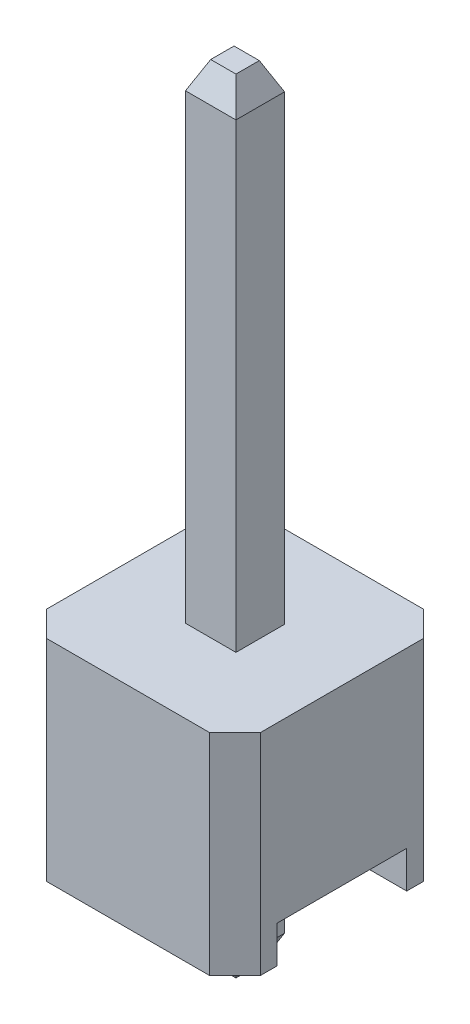
ISO-10303-21;
HEADER;
FILE_DESCRIPTION(('STEP AP214'),'2;1');
FILE_NAME('part.step','',(''),(''),'','','');
FILE_SCHEMA(('AUTOMOTIVE_DESIGN { 1 0 10303 214 1 1 1 1 }'));
ENDSEC;
DATA;
#1=APPLICATION_CONTEXT('core data for automotive mechanical design processes');
#2=APPLICATION_PROTOCOL_DEFINITION('international standard','automotive_design',2000,#1);
#3=PRODUCT_CONTEXT('',#1,'mechanical');
#4=PRODUCT('Part','Part','',(#3));
#5=PRODUCT_RELATED_PRODUCT_CATEGORY('part','',(#4));
#6=PRODUCT_DEFINITION_FORMATION('','',#4);
#7=PRODUCT_DEFINITION_CONTEXT('part definition',#1,'design');
#8=PRODUCT_DEFINITION('design','',#6,#7);
#9=PRODUCT_DEFINITION_SHAPE('','',#8);
#10=(LENGTH_UNIT() NAMED_UNIT(*) SI_UNIT(.MILLI.,.METRE.));
#11=(NAMED_UNIT(*) PLANE_ANGLE_UNIT() SI_UNIT($,.RADIAN.));
#12=(NAMED_UNIT(*) SI_UNIT($,.STERADIAN.) SOLID_ANGLE_UNIT());
#13=UNCERTAINTY_MEASURE_WITH_UNIT(LENGTH_MEASURE(1.E-05),#10,'distance_accuracy_value','');
#14=(GEOMETRIC_REPRESENTATION_CONTEXT(3) GLOBAL_UNCERTAINTY_ASSIGNED_CONTEXT((#13)) GLOBAL_UNIT_ASSIGNED_CONTEXT((#10,
#11,#12)) REPRESENTATION_CONTEXT('',''));
#15=CARTESIAN_POINT('',(0.,0.,0.));
#16=DIRECTION('',(0.,0.,1.));
#17=DIRECTION('',(1.,0.,0.));
#18=AXIS2_PLACEMENT_3D('',#15,#16,#17);
#19=CARTESIAN_POINT('',(15.6674969604626,-5.69124998633488,4.81287404611807));
#20=DIRECTION('',(0.,-1.,0.));
#21=DIRECTION('',(0.,0.,-1.));
#22=AXIS2_PLACEMENT_3D('',#19,#20,#21);
#23=PLANE('',#22);
#24=DIRECTION('',(1.,0.,0.));
#25=VECTOR('',#24,1.);
#26=CARTESIAN_POINT('',(15.0674969604626,-5.69124998633488,4.96287404611807));
#27=LINE('',#26,#25);
#28=CARTESIAN_POINT('',(15.2174969604626,-5.69124998633488,4.96287404611807));
#29=VERTEX_POINT('',#28);
#30=CARTESIAN_POINT('',(15.5174969604626,-5.69124998633488,4.96287404611807));
#31=VERTEX_POINT('',#30);
#32=EDGE_CURVE('E193',#29,#31,#27,.T.);
#33=ORIENTED_EDGE('',*,*,#32,.T.);
#34=DIRECTION('',(0.,0.,1.));
#35=VECTOR('',#34,1.);
#36=CARTESIAN_POINT('',(15.5174969604626,-5.69124998633488,4.81287404611807));
#37=LINE('',#36,#35);
#38=CARTESIAN_POINT('',(15.5174969604626,-5.69124998633488,5.24038017622598));
#39=VERTEX_POINT('',#38);
#40=EDGE_CURVE('E178',#31,#39,#37,.T.);
#41=ORIENTED_EDGE('',*,*,#40,.T.);
#42=DIRECTION('',(1.,0.,0.));
#43=VECTOR('',#42,1.);
#44=CARTESIAN_POINT('',(15.6674969604626,-5.69124998633488,5.24038017622598));
#45=LINE('',#44,#43);
#46=CARTESIAN_POINT('',(15.2174969604626,-5.69124998633488,5.24038017622598));
#47=VERTEX_POINT('',#46);
#48=EDGE_CURVE('E19',#39,#47,#45,.F.);
#49=ORIENTED_EDGE('',*,*,#48,.T.);
#50=DIRECTION('',(0.,0.,1.));
#51=VECTOR('',#50,1.);
#52=CARTESIAN_POINT('',(15.2174969604626,-5.69124998633488,5.39038017622598));
#53=LINE('',#52,#51);
#54=EDGE_CURVE('E173',#47,#29,#53,.F.);
#55=ORIENTED_EDGE('',*,*,#54,.T.);
#56=EDGE_LOOP('',(#33,#41,#49,#55));
#57=FACE_BOUND('',#56,.T.);
#58=ADVANCED_FACE('F16',(#57),#23,.T.);
#59=CARTESIAN_POINT('',(15.6674969604626,-5.36957394825845,5.39038017622598));
#60=DIRECTION('',(0.,0.4226182617407,-0.90630778703665));
#61=DIRECTION('',(0.,0.90630778703665,0.4226182617407));
#62=AXIS2_PLACEMENT_3D('',#59,#60,#61);
#63=PLANE('',#62);
#64=DIRECTION('',(1.,0.,0.));
#65=VECTOR('',#64,1.);
#66=CARTESIAN_POINT('',(15.6674969604626,-5.36957394825845,5.39038017622598));
#67=LINE('',#66,#65);
#68=CARTESIAN_POINT('',(15.0674969604626,-5.36957394825845,5.39038017622598));
#69=VERTEX_POINT('',#68);
#70=CARTESIAN_POINT('',(15.6674969604626,-5.36957394825845,5.39038017622598));
#71=VERTEX_POINT('',#70);
#72=EDGE_CURVE('E185',#69,#71,#67,.T.);
#73=ORIENTED_EDGE('',*,*,#72,.F.);
#74=DIRECTION('',(0.389281620635027,-0.834817129478987,-0.389281620635025));
#75=VECTOR('',#74,1.);
#76=CARTESIAN_POINT('',(15.0674969604626,-5.36957394825845,5.39038017622598));
#77=LINE('',#76,#75);
#78=EDGE_CURVE('E181',#69,#47,#77,.T.);
#79=ORIENTED_EDGE('',*,*,#78,.T.);
#80=ORIENTED_EDGE('',*,*,#48,.F.);
#81=DIRECTION('',(0.389281620635028,0.834817129478986,0.389281620635026));
#82=VECTOR('',#81,1.);
#83=CARTESIAN_POINT('',(15.5174969604626,-5.69124998633488,5.24038017622598));
#84=LINE('',#83,#82);
#85=EDGE_CURVE('E201',#39,#71,#84,.T.);
#86=ORIENTED_EDGE('',*,*,#85,.T.);
#87=EDGE_LOOP('',(#73,#79,#80,#86));
#88=FACE_BOUND('',#87,.T.);
#89=ADVANCED_FACE('F183',(#88),#63,.F.);
#90=CARTESIAN_POINT('',(15.0674969604626,-5.36957394825845,5.39038017622598));
#91=DIRECTION('',(0.906307787036649,0.422618261740701,0.));
#92=DIRECTION('',(-0.422618261740701,0.906307787036649,0.));
#93=AXIS2_PLACEMENT_3D('',#90,#91,#92);
#94=PLANE('',#93);
#95=ORIENTED_EDGE('',*,*,#54,.F.);
#96=ORIENTED_EDGE('',*,*,#78,.F.);
#97=DIRECTION('',(0.,0.,1.));
#98=VECTOR('',#97,1.);
#99=CARTESIAN_POINT('',(15.0674969604626,-5.36957394825845,5.39038017622598));
#100=LINE('',#99,#98);
#101=CARTESIAN_POINT('',(15.0674969604626,-5.36957394825845,4.81287404611807));
#102=VERTEX_POINT('',#101);
#103=EDGE_CURVE('E204',#102,#69,#100,.T.);
#104=ORIENTED_EDGE('',*,*,#103,.F.);
#105=DIRECTION('',(0.389281620635028,-0.834817129478986,0.389281620635026));
#106=VECTOR('',#105,1.);
#107=CARTESIAN_POINT('',(15.0674969604626,-5.36957394825845,4.81287404611807));
#108=LINE('',#107,#106);
#109=EDGE_CURVE('E190',#102,#29,#108,.T.);
#110=ORIENTED_EDGE('',*,*,#109,.T.);
#111=EDGE_LOOP('',(#95,#96,#104,#110));
#112=FACE_BOUND('',#111,.T.);
#113=ADVANCED_FACE('F188',(#112),#94,.F.);
#114=CARTESIAN_POINT('',(15.0674969604626,-5.36957394825845,4.81287404611807));
#115=DIRECTION('',(0.,0.422618261740701,0.906307787036649));
#116=DIRECTION('',(0.,-0.906307787036649,0.422618261740701));
#117=AXIS2_PLACEMENT_3D('',#114,#115,#116);
#118=PLANE('',#117);
#119=ORIENTED_EDGE('',*,*,#32,.F.);
#120=ORIENTED_EDGE('',*,*,#109,.F.);
#121=DIRECTION('',(-1.,0.,0.));
#122=VECTOR('',#121,1.);
#123=CARTESIAN_POINT('',(15.0674969604626,-5.36957394825845,4.81287404611807));
#124=LINE('',#123,#122);
#125=CARTESIAN_POINT('',(15.6674969604626,-5.36957394825845,4.81287404611807));
#126=VERTEX_POINT('',#125);
#127=EDGE_CURVE('E210',#126,#102,#124,.T.);
#128=ORIENTED_EDGE('',*,*,#127,.F.);
#129=DIRECTION('',(-0.389281620635029,-0.834817129478987,0.389281620635022));
#130=VECTOR('',#129,1.);
#131=CARTESIAN_POINT('',(15.6674969604626,-5.36957394825845,4.81287404611807));
#132=LINE('',#131,#130);
#133=EDGE_CURVE('E197',#126,#31,#132,.T.);
#134=ORIENTED_EDGE('',*,*,#133,.T.);
#135=EDGE_LOOP('',(#119,#120,#128,#134));
#136=FACE_BOUND('',#135,.T.);
#137=ADVANCED_FACE('F517',(#136),#118,.F.);
#138=CARTESIAN_POINT('',(15.6674969604626,-5.36957394825845,4.81287404611807));
#139=DIRECTION('',(-0.906307787036649,0.422618261740701,0.));
#140=DIRECTION('',(-0.422618261740701,-0.906307787036649,0.));
#141=AXIS2_PLACEMENT_3D('',#138,#139,#140);
#142=PLANE('',#141);
#143=ORIENTED_EDGE('',*,*,#40,.F.);
#144=ORIENTED_EDGE('',*,*,#133,.F.);
#145=DIRECTION('',(0.,0.,-1.));
#146=VECTOR('',#145,1.);
#147=CARTESIAN_POINT('',(15.6674969604626,-5.36957394825845,4.81287404611807));
#148=LINE('',#147,#146);
#149=EDGE_CURVE('E219',#71,#126,#148,.T.);
#150=ORIENTED_EDGE('',*,*,#149,.F.);
#151=ORIENTED_EDGE('',*,*,#85,.F.);
#152=EDGE_LOOP('',(#143,#144,#150,#151));
#153=FACE_BOUND('',#152,.T.);
#154=ADVANCED_FACE('F513',(#153),#142,.F.);
#155=CARTESIAN_POINT('',(15.6674969604626,-5.69124998633488,5.39038017622598));
#156=DIRECTION('',(0.,0.,1.));
#157=DIRECTION('',(1.,0.,0.));
#158=AXIS2_PLACEMENT_3D('',#155,#156,#157);
#159=PLANE('',#158);
#160=DIRECTION('',(0.,1.,0.));
#161=VECTOR('',#160,1.);
#162=CARTESIAN_POINT('',(15.6674969604626,-5.69124998633488,5.39038017622598));
#163=LINE('',#162,#161);
#164=CARTESIAN_POINT('',(15.6674969604626,-4.25124998633488,5.39038017622598));
#165=VERTEX_POINT('',#164);
#166=EDGE_CURVE('E216',#165,#71,#163,.F.);
#167=ORIENTED_EDGE('',*,*,#166,.F.);
#168=DIRECTION('',(1.,0.,0.));
#169=VECTOR('',#168,1.);
#170=CARTESIAN_POINT('',(14.0974969604626,-4.25124998633488,5.39038017622598));
#171=LINE('',#170,#169);
#172=CARTESIAN_POINT('',(15.0674969604626,-4.25124998633488,5.39038017622598));
#173=VERTEX_POINT('',#172);
#174=EDGE_CURVE('E229',#165,#173,#171,.F.);
#175=ORIENTED_EDGE('',*,*,#174,.T.);
#176=DIRECTION('',(0.,1.,0.));
#177=VECTOR('',#176,1.);
#178=CARTESIAN_POINT('',(15.0674969604626,-5.69124998633488,5.39038017622598));
#179=LINE('',#178,#177);
#180=EDGE_CURVE('E207',#69,#173,#179,.T.);
#181=ORIENTED_EDGE('',*,*,#180,.F.);
#182=ORIENTED_EDGE('',*,*,#72,.T.);
#183=EDGE_LOOP('',(#167,#175,#181,#182));
#184=FACE_BOUND('',#183,.T.);
#185=ADVANCED_FACE('F509',(#184),#159,.T.);
#186=CARTESIAN_POINT('',(15.0674969604626,-5.69124998633488,5.39038017622598));
#187=DIRECTION('',(-1.,0.,0.));
#188=DIRECTION('',(0.,0.,1.));
#189=AXIS2_PLACEMENT_3D('',#186,#187,#188);
#190=PLANE('',#189);
#191=ORIENTED_EDGE('',*,*,#180,.T.);
#192=DIRECTION('',(0.,0.,1.));
#193=VECTOR('',#192,1.);
#194=CARTESIAN_POINT('',(15.0674969604626,-4.25124998633488,5.87162711117202));
#195=LINE('',#194,#193);
#196=CARTESIAN_POINT('',(15.0674969604626,-4.25124998633488,4.81287404611807));
#197=VERTEX_POINT('',#196);
#198=EDGE_CURVE('E231',#173,#197,#195,.F.);
#199=ORIENTED_EDGE('',*,*,#198,.T.);
#200=DIRECTION('',(0.,1.,0.));
#201=VECTOR('',#200,1.);
#202=CARTESIAN_POINT('',(15.0674969604626,-5.69124998633488,4.81287404611807));
#203=LINE('',#202,#201);
#204=EDGE_CURVE('E213',#102,#197,#203,.T.);
#205=ORIENTED_EDGE('',*,*,#204,.F.);
#206=ORIENTED_EDGE('',*,*,#103,.T.);
#207=EDGE_LOOP('',(#191,#199,#205,#206));
#208=FACE_BOUND('',#207,.T.);
#209=ADVANCED_FACE('F505',(#208),#190,.T.);
#210=CARTESIAN_POINT('',(15.0674969604626,-5.69124998633488,4.81287404611807));
#211=DIRECTION('',(0.,0.,-1.));
#212=DIRECTION('',(-1.,0.,0.));
#213=AXIS2_PLACEMENT_3D('',#210,#211,#212);
#214=PLANE('',#213);
#215=ORIENTED_EDGE('',*,*,#204,.T.);
#216=DIRECTION('',(1.,0.,0.));
#217=VECTOR('',#216,1.);
#218=CARTESIAN_POINT('',(14.0974969604626,-4.25124998633488,4.81287404611807));
#219=LINE('',#218,#217);
#220=CARTESIAN_POINT('',(15.6674969604626,-4.25124998633488,4.81287404611807));
#221=VERTEX_POINT('',#220);
#222=EDGE_CURVE('E233',#197,#221,#219,.T.);
#223=ORIENTED_EDGE('',*,*,#222,.T.);
#224=DIRECTION('',(0.,1.,0.));
#225=VECTOR('',#224,1.);
#226=CARTESIAN_POINT('',(15.6674969604626,-5.69124998633488,4.81287404611807));
#227=LINE('',#226,#225);
#228=EDGE_CURVE('E222',#126,#221,#227,.T.);
#229=ORIENTED_EDGE('',*,*,#228,.F.);
#230=ORIENTED_EDGE('',*,*,#127,.T.);
#231=EDGE_LOOP('',(#215,#223,#229,#230));
#232=FACE_BOUND('',#231,.T.);
#233=ADVANCED_FACE('F501',(#232),#214,.T.);
#234=CARTESIAN_POINT('',(15.6674969604626,-5.69124998633488,4.81287404611807));
#235=DIRECTION('',(1.,0.,0.));
#236=DIRECTION('',(0.,0.,-1.));
#237=AXIS2_PLACEMENT_3D('',#234,#235,#236);
#238=PLANE('',#237);
#239=ORIENTED_EDGE('',*,*,#228,.T.);
#240=DIRECTION('',(0.,0.,1.));
#241=VECTOR('',#240,1.);
#242=CARTESIAN_POINT('',(15.6674969604626,-4.25124998633488,5.87162711117202));
#243=LINE('',#242,#241);
#244=EDGE_CURVE('E235',#221,#165,#243,.T.);
#245=ORIENTED_EDGE('',*,*,#244,.T.);
#246=ORIENTED_EDGE('',*,*,#166,.T.);
#247=ORIENTED_EDGE('',*,*,#149,.T.);
#248=EDGE_LOOP('',(#239,#245,#246,#247));
#249=FACE_BOUND('',#248,.T.);
#250=ADVANCED_FACE('F497',(#249),#238,.T.);
#251=CARTESIAN_POINT('',(14.0974969604626,-4.25124998633488,5.87162711117202));
#252=DIRECTION('',(0.,1.,0.));
#253=DIRECTION('',(0.,0.,1.));
#254=AXIS2_PLACEMENT_3D('',#251,#252,#253);
#255=PLANE('',#254);
#256=ORIENTED_EDGE('',*,*,#222,.F.);
#257=ORIENTED_EDGE('',*,*,#198,.F.);
#258=ORIENTED_EDGE('',*,*,#174,.F.);
#259=ORIENTED_EDGE('',*,*,#244,.F.);
#260=EDGE_LOOP('',(#256,#257,#258,#259));
#261=FACE_BOUND('',#260,.T.);
#262=DIRECTION('',(-1.,0.,0.));
#263=VECTOR('',#262,1.);
#264=CARTESIAN_POINT('',(14.0974969604626,-4.25124998633488,4.33162711117202));
#265=LINE('',#264,#263);
#266=CARTESIAN_POINT('',(14.0974969604626,-4.25124998633488,4.33162711117202));
#267=VERTEX_POINT('',#266);
#268=CARTESIAN_POINT('',(16.6374969604626,-4.25124998633488,4.33162711117202));
#269=VERTEX_POINT('',#268);
#270=EDGE_CURVE('E240',#267,#269,#265,.F.);
#271=ORIENTED_EDGE('',*,*,#270,.T.);
#272=DIRECTION('',(0.,0.,1.));
#273=VECTOR('',#272,1.);
#274=CARTESIAN_POINT('',(16.6374969604626,-4.25124998633488,5.87162711117202));
#275=LINE('',#274,#273);
#276=CARTESIAN_POINT('',(16.6374969604626,-4.25124998633488,5.87162711117202));
#277=VERTEX_POINT('',#276);
#278=EDGE_CURVE('E225',#277,#269,#275,.F.);
#279=ORIENTED_EDGE('',*,*,#278,.F.);
#280=DIRECTION('',(1.,0.,0.));
#281=VECTOR('',#280,1.);
#282=CARTESIAN_POINT('',(14.0974969604626,-4.25124998633488,5.87162711117202));
#283=LINE('',#282,#281);
#284=CARTESIAN_POINT('',(14.0974969604626,-4.25124998633488,5.87162711117202));
#285=VERTEX_POINT('',#284);
#286=EDGE_CURVE('E247',#277,#285,#283,.F.);
#287=ORIENTED_EDGE('',*,*,#286,.T.);
#288=DIRECTION('',(0.,0.,1.));
#289=VECTOR('',#288,1.);
#290=CARTESIAN_POINT('',(14.0974969604626,-4.25124998633488,5.87162711117202));
#291=LINE('',#290,#289);
#292=EDGE_CURVE('E227',#267,#285,#291,.T.);
#293=ORIENTED_EDGE('',*,*,#292,.F.);
#294=EDGE_LOOP('',(#271,#279,#287,#293));
#295=FACE_BOUND('',#294,.T.);
#296=ADVANCED_FACE('F494',(#261,#295),#255,.F.);
#297=CARTESIAN_POINT('',(15.5174969604626,3.60875001366512,4.81287404611807));
#298=DIRECTION('',(0.906307787036651,0.422618261740697,0.));
#299=DIRECTION('',(-0.422618261740697,0.906307787036651,0.));
#300=AXIS2_PLACEMENT_3D('',#297,#298,#299);
#301=PLANE('',#300);
#302=DIRECTION('',(0.389281620635022,-0.83481712947899,-0.389281620635024));
#303=VECTOR('',#302,1.);
#304=CARTESIAN_POINT('',(15.5174969604626,3.60875001366512,4.96287404611807));
#305=LINE('',#304,#303);
#306=CARTESIAN_POINT('',(15.5174969604626,3.60875001366512,4.96287404611807));
#307=VERTEX_POINT('',#306);
#308=CARTESIAN_POINT('',(15.6674969604626,3.28707397558869,4.81287404611807));
#309=VERTEX_POINT('',#308);
#310=EDGE_CURVE('E262',#307,#309,#305,.T.);
#311=ORIENTED_EDGE('',*,*,#310,.F.);
#312=DIRECTION('',(0.,0.,-1.));
#313=VECTOR('',#312,1.);
#314=CARTESIAN_POINT('',(15.5174969604626,3.60875001366512,4.81287404611807));
#315=LINE('',#314,#313);
#316=CARTESIAN_POINT('',(15.5174969604626,3.60875001366512,5.24038017622598));
#317=VERTEX_POINT('',#316);
#318=EDGE_CURVE('E255',#307,#317,#315,.F.);
#319=ORIENTED_EDGE('',*,*,#318,.T.);
#320=DIRECTION('',(-0.389281620635021,0.834817129478991,-0.389281620635023));
#321=VECTOR('',#320,1.);
#322=CARTESIAN_POINT('',(15.6674969604626,3.28707397558869,5.39038017622598));
#323=LINE('',#322,#321);
#324=CARTESIAN_POINT('',(15.6674969604626,3.28707397558869,5.39038017622598));
#325=VERTEX_POINT('',#324);
#326=EDGE_CURVE('E252',#325,#317,#323,.T.);
#327=ORIENTED_EDGE('',*,*,#326,.F.);
#328=DIRECTION('',(0.,0.,-1.));
#329=VECTOR('',#328,1.);
#330=CARTESIAN_POINT('',(15.6674969604626,3.28707397558869,4.81287404611807));
#331=LINE('',#330,#329);
#332=EDGE_CURVE('E265',#309,#325,#331,.F.);
#333=ORIENTED_EDGE('',*,*,#332,.F.);
#334=EDGE_LOOP('',(#311,#319,#327,#333));
#335=FACE_BOUND('',#334,.T.);
#336=ADVANCED_FACE('F471',(#335),#301,.T.);
#337=CARTESIAN_POINT('',(14.0974969604626,-4.25124998633488,4.33162711117202));
#338=DIRECTION('',(0.,0.,-1.));
#339=DIRECTION('',(-1.,0.,0.));
#340=AXIS2_PLACEMENT_3D('',#337,#338,#339);
#341=PLANE('',#340);
#342=DIRECTION('',(0.,1.,0.));
#343=VECTOR('',#342,1.);
#344=CARTESIAN_POINT('',(16.6374969604626,-4.25124998633488,4.33162711117202));
#345=LINE('',#344,#343);
#346=CARTESIAN_POINT('',(16.6374969604626,-4.69124998633488,4.33162711117202));
#347=VERTEX_POINT('',#346);
#348=EDGE_CURVE('E243',#269,#347,#345,.F.);
#349=ORIENTED_EDGE('',*,*,#348,.F.);
#350=ORIENTED_EDGE('',*,*,#270,.F.);
#351=DIRECTION('',(0.,1.,0.));
#352=VECTOR('',#351,1.);
#353=CARTESIAN_POINT('',(14.0974969604626,-4.25124998633488,4.33162711117202));
#354=LINE('',#353,#352);
#355=CARTESIAN_POINT('',(14.0974969604626,-4.69124998633488,4.33162711117202));
#356=VERTEX_POINT('',#355);
#357=EDGE_CURVE('E238',#356,#267,#354,.T.);
#358=ORIENTED_EDGE('',*,*,#357,.F.);
#359=DIRECTION('',(1.,0.,0.));
#360=VECTOR('',#359,1.);
#361=CARTESIAN_POINT('',(15.3674969604626,-4.69124998633488,4.33162711117202));
#362=LINE('',#361,#360);
#363=EDGE_CURVE('E272',#356,#347,#362,.T.);
#364=ORIENTED_EDGE('',*,*,#363,.T.);
#365=EDGE_LOOP('',(#349,#350,#358,#364));
#366=FACE_BOUND('',#365,.T.);
#367=ADVANCED_FACE('F487',(#366),#341,.F.);
#368=CARTESIAN_POINT('',(14.0974969604626,-4.25124998633488,5.87162711117202));
#369=DIRECTION('',(0.,0.,1.));
#370=DIRECTION('',(1.,0.,0.));
#371=AXIS2_PLACEMENT_3D('',#368,#369,#370);
#372=PLANE('',#371);
#373=DIRECTION('',(0.,1.,0.));
#374=VECTOR('',#373,1.);
#375=CARTESIAN_POINT('',(14.0974969604626,-4.25124998633488,5.87162711117202));
#376=LINE('',#375,#374);
#377=CARTESIAN_POINT('',(14.0974969604626,-4.69124998633488,5.87162711117202));
#378=VERTEX_POINT('',#377);
#379=EDGE_CURVE('E250',#285,#378,#376,.F.);
#380=ORIENTED_EDGE('',*,*,#379,.F.);
#381=ORIENTED_EDGE('',*,*,#286,.F.);
#382=DIRECTION('',(0.,1.,0.));
#383=VECTOR('',#382,1.);
#384=CARTESIAN_POINT('',(16.6374969604626,-4.25124998633488,5.87162711117202));
#385=LINE('',#384,#383);
#386=CARTESIAN_POINT('',(16.6374969604626,-4.69124998633488,5.87162711117202));
#387=VERTEX_POINT('',#386);
#388=EDGE_CURVE('E245',#387,#277,#385,.T.);
#389=ORIENTED_EDGE('',*,*,#388,.F.);
#390=DIRECTION('',(1.,0.,0.));
#391=VECTOR('',#390,1.);
#392=CARTESIAN_POINT('',(15.3674969604626,-4.69124998633488,5.87162711117202));
#393=LINE('',#392,#391);
#394=EDGE_CURVE('E287',#387,#378,#393,.F.);
#395=ORIENTED_EDGE('',*,*,#394,.T.);
#396=EDGE_LOOP('',(#380,#381,#389,#395));
#397=FACE_BOUND('',#396,.T.);
#398=ADVANCED_FACE('F481',(#397),#372,.F.);
#399=CARTESIAN_POINT('',(15.6674969604626,3.60875001366512,5.24038017622598));
#400=DIRECTION('',(0.,0.422618261740697,0.906307787036651));
#401=DIRECTION('',(0.,-0.906307787036651,0.422618261740697));
#402=AXIS2_PLACEMENT_3D('',#399,#400,#401);
#403=PLANE('',#402);
#404=ORIENTED_EDGE('',*,*,#326,.T.);
#405=DIRECTION('',(1.,0.,0.));
#406=VECTOR('',#405,1.);
#407=CARTESIAN_POINT('',(15.6674969604626,3.60875001366512,5.24038017622598));
#408=LINE('',#407,#406);
#409=CARTESIAN_POINT('',(15.2174969604626,3.60875001366512,5.24038017622598));
#410=VERTEX_POINT('',#409);
#411=EDGE_CURVE('E257',#317,#410,#408,.F.);
#412=ORIENTED_EDGE('',*,*,#411,.T.);
#413=DIRECTION('',(0.389281620635024,0.83481712947899,-0.389281620635022));
#414=VECTOR('',#413,1.);
#415=CARTESIAN_POINT('',(15.0674969604626,3.28707397558869,5.39038017622598));
#416=LINE('',#415,#414);
#417=CARTESIAN_POINT('',(15.0674969604626,3.28707397558869,5.39038017622598));
#418=VERTEX_POINT('',#417);
#419=EDGE_CURVE('E309',#418,#410,#416,.T.);
#420=ORIENTED_EDGE('',*,*,#419,.F.);
#421=DIRECTION('',(1.,0.,0.));
#422=VECTOR('',#421,1.);
#423=CARTESIAN_POINT('',(15.6674969604626,3.28707397558869,5.39038017622598));
#424=LINE('',#423,#422);
#425=EDGE_CURVE('E302',#325,#418,#424,.F.);
#426=ORIENTED_EDGE('',*,*,#425,.F.);
#427=EDGE_LOOP('',(#404,#412,#420,#426));
#428=FACE_BOUND('',#427,.T.);
#429=ADVANCED_FACE('F465',(#428),#403,.T.);
#430=CARTESIAN_POINT('',(15.6674969604626,3.60875001366512,4.81287404611807));
#431=DIRECTION('',(0.,-1.,0.));
#432=DIRECTION('',(0.,0.,-1.));
#433=AXIS2_PLACEMENT_3D('',#430,#431,#432);
#434=PLANE('',#433);
#435=ORIENTED_EDGE('',*,*,#318,.F.);
#436=DIRECTION('',(1.,0.,0.));
#437=VECTOR('',#436,1.);
#438=CARTESIAN_POINT('',(15.6674969604626,3.60875001366512,4.96287404611807));
#439=LINE('',#438,#437);
#440=CARTESIAN_POINT('',(15.2174969604626,3.60875001366512,4.96287404611807));
#441=VERTEX_POINT('',#440);
#442=EDGE_CURVE('E259',#441,#307,#439,.T.);
#443=ORIENTED_EDGE('',*,*,#442,.F.);
#444=DIRECTION('',(0.,0.,1.));
#445=VECTOR('',#444,1.);
#446=CARTESIAN_POINT('',(15.2174969604626,3.60875001366512,4.81287404611807));
#447=LINE('',#446,#445);
#448=EDGE_CURVE('E312',#410,#441,#447,.F.);
#449=ORIENTED_EDGE('',*,*,#448,.F.);
#450=ORIENTED_EDGE('',*,*,#411,.F.);
#451=EDGE_LOOP('',(#435,#443,#449,#450));
#452=FACE_BOUND('',#451,.T.);
#453=ADVANCED_FACE('F473',(#452),#434,.F.);
#454=CARTESIAN_POINT('',(15.6674969604626,3.60875001366512,4.96287404611807));
#455=DIRECTION('',(0.,0.422618261740697,-0.906307787036651));
#456=DIRECTION('',(0.,0.906307787036651,0.422618261740697));
#457=AXIS2_PLACEMENT_3D('',#454,#455,#456);
#458=PLANE('',#457);
#459=ORIENTED_EDGE('',*,*,#310,.T.);
#460=DIRECTION('',(-1.,0.,0.));
#461=VECTOR('',#460,1.);
#462=CARTESIAN_POINT('',(15.0674969604626,3.28707397558869,4.81287404611807));
#463=LINE('',#462,#461);
#464=CARTESIAN_POINT('',(15.0674969604626,3.28707397558869,4.81287404611807));
#465=VERTEX_POINT('',#464);
#466=EDGE_CURVE('E315',#465,#309,#463,.F.);
#467=ORIENTED_EDGE('',*,*,#466,.F.);
#468=DIRECTION('',(-0.389281620635025,-0.834817129478991,-0.389281620635018));
#469=VECTOR('',#468,1.);
#470=CARTESIAN_POINT('',(15.2174969604626,3.60875001366512,4.96287404611807));
#471=LINE('',#470,#469);
#472=EDGE_CURVE('E306',#441,#465,#471,.T.);
#473=ORIENTED_EDGE('',*,*,#472,.F.);
#474=ORIENTED_EDGE('',*,*,#442,.T.);
#475=EDGE_LOOP('',(#459,#467,#473,#474));
#476=FACE_BOUND('',#475,.T.);
#477=ADVANCED_FACE('F470',(#476),#458,.T.);
#478=CARTESIAN_POINT('',(15.6674969604626,-5.69124998633488,4.81287404611807));
#479=DIRECTION('',(1.,0.,0.));
#480=DIRECTION('',(0.,0.,-1.));
#481=AXIS2_PLACEMENT_3D('',#478,#479,#480);
#482=PLANE('',#481);
#483=DIRECTION('',(0.,1.,0.));
#484=VECTOR('',#483,1.);
#485=CARTESIAN_POINT('',(15.6674969604626,-5.69124998633488,5.39038017622598));
#486=LINE('',#485,#484);
#487=CARTESIAN_POINT('',(15.6674969604626,-2.19124998633488,5.39038017622598));
#488=VERTEX_POINT('',#487);
#489=EDGE_CURVE('E299',#488,#325,#486,.T.);
#490=ORIENTED_EDGE('',*,*,#489,.F.);
#491=DIRECTION('',(0.,0.,-1.));
#492=VECTOR('',#491,1.);
#493=CARTESIAN_POINT('',(15.6674969604626,-2.19124998633488,4.81287404611807));
#494=LINE('',#493,#492);
#495=CARTESIAN_POINT('',(15.6674969604626,-2.19124998633488,4.81287404611807));
#496=VERTEX_POINT('',#495);
#497=EDGE_CURVE('E268',#488,#496,#494,.T.);
#498=ORIENTED_EDGE('',*,*,#497,.T.);
#499=DIRECTION('',(0.,1.,0.));
#500=VECTOR('',#499,1.);
#501=CARTESIAN_POINT('',(15.6674969604626,-5.69124998633488,4.81287404611807));
#502=LINE('',#501,#500);
#503=EDGE_CURVE('E318',#309,#496,#502,.F.);
#504=ORIENTED_EDGE('',*,*,#503,.F.);
#505=ORIENTED_EDGE('',*,*,#332,.T.);
#506=EDGE_LOOP('',(#490,#498,#504,#505));
#507=FACE_BOUND('',#506,.T.);
#508=ADVANCED_FACE('F461',(#507),#482,.T.);
#509=CARTESIAN_POINT('',(15.3674969604626,-4.69124998633488,2.86162711117202));
#510=DIRECTION('',(0.,1.,0.));
#511=DIRECTION('',(0.,0.,1.));
#512=AXIS2_PLACEMENT_3D('',#509,#510,#511);
#513=PLANE('',#512);
#514=ORIENTED_EDGE('',*,*,#363,.F.);
#515=DIRECTION('',(0.,0.,1.));
#516=VECTOR('',#515,1.);
#517=CARTESIAN_POINT('',(14.0974969604626,-4.69124998633488,2.86162711117202));
#518=LINE('',#517,#516);
#519=CARTESIAN_POINT('',(14.0974969604626,-4.69124998633488,4.13162711117202));
#520=VERTEX_POINT('',#519);
#521=EDGE_CURVE('E270',#520,#356,#518,.T.);
#522=ORIENTED_EDGE('',*,*,#521,.F.);
#523=DIRECTION('',(0.707106781186547,0.,-0.707106781186548));
#524=VECTOR('',#523,1.);
#525=CARTESIAN_POINT('',(14.3974969604626,-4.69124998633488,3.83162711117202));
#526=LINE('',#525,#524);
#527=CARTESIAN_POINT('',(14.3974969604626,-4.69124998633488,3.83162711117202));
#528=VERTEX_POINT('',#527);
#529=EDGE_CURVE('E279',#520,#528,#526,.T.);
#530=ORIENTED_EDGE('',*,*,#529,.T.);
#531=DIRECTION('',(1.,0.,0.));
#532=VECTOR('',#531,1.);
#533=CARTESIAN_POINT('',(16.3374969604626,-4.69124998633488,3.83162711117202));
#534=LINE('',#533,#532);
#535=CARTESIAN_POINT('',(16.3374969604626,-4.69124998633488,3.83162711117202));
#536=VERTEX_POINT('',#535);
#537=EDGE_CURVE('E329',#528,#536,#534,.T.);
#538=ORIENTED_EDGE('',*,*,#537,.T.);
#539=DIRECTION('',(0.707106781186546,0.,0.707106781186549));
#540=VECTOR('',#539,1.);
#541=CARTESIAN_POINT('',(16.6374969604626,-4.69124998633488,4.13162711117202));
#542=LINE('',#541,#540);
#543=CARTESIAN_POINT('',(16.6374969604626,-4.69124998633488,4.13162711117202));
#544=VERTEX_POINT('',#543);
#545=EDGE_CURVE('E296',#536,#544,#542,.T.);
#546=ORIENTED_EDGE('',*,*,#545,.T.);
#547=DIRECTION('',(0.,0.,1.));
#548=VECTOR('',#547,1.);
#549=CARTESIAN_POINT('',(16.6374969604626,-4.69124998633488,2.86162711117202));
#550=LINE('',#549,#548);
#551=EDGE_CURVE('E275',#347,#544,#550,.F.);
#552=ORIENTED_EDGE('',*,*,#551,.F.);
#553=EDGE_LOOP('',(#514,#522,#530,#538,#546,#552));
#554=FACE_BOUND('',#553,.T.);
#555=ADVANCED_FACE('F633',(#554),#513,.F.);
#556=CARTESIAN_POINT('',(14.3974969604626,-2.19124998633488,3.83162711117202));
#557=DIRECTION('',(0.707106781186548,0.,0.707106781186547));
#558=DIRECTION('',(0.707106781186547,0.,-0.707106781186548));
#559=AXIS2_PLACEMENT_3D('',#556,#557,#558);
#560=PLANE('',#559);
#561=DIRECTION('',(0.,1.,0.));
#562=VECTOR('',#561,1.);
#563=CARTESIAN_POINT('',(14.0974969604626,-2.19124998633488,4.13162711117202));
#564=LINE('',#563,#562);
#565=CARTESIAN_POINT('',(14.0974969604626,-2.19124998633488,4.13162711117202));
#566=VERTEX_POINT('',#565);
#567=EDGE_CURVE('E332',#520,#566,#564,.T.);
#568=ORIENTED_EDGE('',*,*,#567,.T.);
#569=DIRECTION('',(0.707106781186547,0.,-0.707106781186548));
#570=VECTOR('',#569,1.);
#571=CARTESIAN_POINT('',(14.3974969604626,-2.19124998633488,3.83162711117202));
#572=LINE('',#571,#570);
#573=CARTESIAN_POINT('',(14.3974969604626,-2.19124998633488,3.83162711117202));
#574=VERTEX_POINT('',#573);
#575=EDGE_CURVE('E277',#574,#566,#572,.F.);
#576=ORIENTED_EDGE('',*,*,#575,.F.);
#577=DIRECTION('',(0.,1.,0.));
#578=VECTOR('',#577,1.);
#579=CARTESIAN_POINT('',(14.3974969604626,-2.19124998633488,3.83162711117202));
#580=LINE('',#579,#578);
#581=EDGE_CURVE('E326',#574,#528,#580,.F.);
#582=ORIENTED_EDGE('',*,*,#581,.T.);
#583=ORIENTED_EDGE('',*,*,#529,.F.);
#584=EDGE_LOOP('',(#568,#576,#582,#583));
#585=FACE_BOUND('',#584,.T.);
#586=ADVANCED_FACE('F394',(#585),#560,.F.);
#587=CARTESIAN_POINT('',(14.0974969604626,-2.19124998633488,6.07162711117202));
#588=DIRECTION('',(0.707106781186547,0.,-0.707106781186548));
#589=DIRECTION('',(-0.707106781186548,0.,-0.707106781186547));
#590=AXIS2_PLACEMENT_3D('',#587,#588,#589);
#591=PLANE('',#590);
#592=DIRECTION('',(0.,1.,0.));
#593=VECTOR('',#592,1.);
#594=CARTESIAN_POINT('',(14.3974969604626,-2.19124998633488,6.37162711117202));
#595=LINE('',#594,#593);
#596=CARTESIAN_POINT('',(14.3974969604626,-4.69124998633488,6.37162711117202));
#597=VERTEX_POINT('',#596);
#598=CARTESIAN_POINT('',(14.3974969604626,-2.19124998633488,6.37162711117202));
#599=VERTEX_POINT('',#598);
#600=EDGE_CURVE('E340',#597,#599,#595,.T.);
#601=ORIENTED_EDGE('',*,*,#600,.T.);
#602=DIRECTION('',(-0.707106781186548,0.,-0.707106781186547));
#603=VECTOR('',#602,1.);
#604=CARTESIAN_POINT('',(14.0974969604626,-2.19124998633488,6.07162711117202));
#605=LINE('',#604,#603);
#606=CARTESIAN_POINT('',(14.0974969604626,-2.19124998633488,6.07162711117202));
#607=VERTEX_POINT('',#606);
#608=EDGE_CURVE('E281',#607,#599,#605,.F.);
#609=ORIENTED_EDGE('',*,*,#608,.F.);
#610=DIRECTION('',(0.,1.,0.));
#611=VECTOR('',#610,1.);
#612=CARTESIAN_POINT('',(14.0974969604626,-2.19124998633488,6.07162711117202));
#613=LINE('',#612,#611);
#614=CARTESIAN_POINT('',(14.0974969604626,-4.69124998633488,6.07162711117202));
#615=VERTEX_POINT('',#614);
#616=EDGE_CURVE('E335',#607,#615,#613,.F.);
#617=ORIENTED_EDGE('',*,*,#616,.T.);
#618=DIRECTION('',(0.707106781186551,0.,0.707106781186544));
#619=VECTOR('',#618,1.);
#620=CARTESIAN_POINT('',(14.0974969604626,-4.69124998633488,6.07162711117202));
#621=LINE('',#620,#619);
#622=EDGE_CURVE('E283',#615,#597,#621,.T.);
#623=ORIENTED_EDGE('',*,*,#622,.T.);
#624=EDGE_LOOP('',(#601,#609,#617,#623));
#625=FACE_BOUND('',#624,.T.);
#626=ADVANCED_FACE('F401',(#625),#591,.F.);
#627=CARTESIAN_POINT('',(15.3674969604626,-4.69124998633488,2.86162711117202));
#628=DIRECTION('',(0.,1.,0.));
#629=DIRECTION('',(0.,0.,1.));
#630=AXIS2_PLACEMENT_3D('',#627,#628,#629);
#631=PLANE('',#630);
#632=ORIENTED_EDGE('',*,*,#394,.F.);
#633=DIRECTION('',(0.,0.,1.));
#634=VECTOR('',#633,1.);
#635=CARTESIAN_POINT('',(16.6374969604626,-4.69124998633488,2.86162711117202));
#636=LINE('',#635,#634);
#637=CARTESIAN_POINT('',(16.6374969604626,-4.69124998633488,6.07162711117202));
#638=VERTEX_POINT('',#637);
#639=EDGE_CURVE('E285',#638,#387,#636,.F.);
#640=ORIENTED_EDGE('',*,*,#639,.F.);
#641=DIRECTION('',(-0.707106781186549,0.,0.707106781186546));
#642=VECTOR('',#641,1.);
#643=CARTESIAN_POINT('',(16.3374969604626,-4.69124998633488,6.37162711117202));
#644=LINE('',#643,#642);
#645=CARTESIAN_POINT('',(16.3374969604626,-4.69124998633488,6.37162711117202));
#646=VERTEX_POINT('',#645);
#647=EDGE_CURVE('E292',#638,#646,#644,.T.);
#648=ORIENTED_EDGE('',*,*,#647,.T.);
#649=DIRECTION('',(-1.,0.,0.));
#650=VECTOR('',#649,1.);
#651=CARTESIAN_POINT('',(14.3974969604626,-4.69124998633488,6.37162711117202));
#652=LINE('',#651,#650);
#653=EDGE_CURVE('E346',#646,#597,#652,.T.);
#654=ORIENTED_EDGE('',*,*,#653,.T.);
#655=ORIENTED_EDGE('',*,*,#622,.F.);
#656=DIRECTION('',(0.,0.,-1.));
#657=VECTOR('',#656,1.);
#658=CARTESIAN_POINT('',(14.0974969604626,-4.69124998633488,4.13162711117202));
#659=LINE('',#658,#657);
#660=EDGE_CURVE('E337',#615,#378,#659,.T.);
#661=ORIENTED_EDGE('',*,*,#660,.T.);
#662=EDGE_LOOP('',(#632,#640,#648,#654,#655,#661));
#663=FACE_BOUND('',#662,.T.);
#664=ADVANCED_FACE('F404',(#663),#631,.F.);
#665=CARTESIAN_POINT('',(16.3374969604626,-2.19124998633488,6.37162711117202));
#666=DIRECTION('',(-0.707106781186546,0.,-0.707106781186549));
#667=DIRECTION('',(-0.707106781186549,0.,0.707106781186546));
#668=AXIS2_PLACEMENT_3D('',#665,#666,#667);
#669=PLANE('',#668);
#670=DIRECTION('',(0.,1.,0.));
#671=VECTOR('',#670,1.);
#672=CARTESIAN_POINT('',(16.6374969604626,-2.19124998633488,6.07162711117202));
#673=LINE('',#672,#671);
#674=CARTESIAN_POINT('',(16.6374969604626,-2.19124998633488,6.07162711117202));
#675=VERTEX_POINT('',#674);
#676=EDGE_CURVE('E349',#638,#675,#673,.T.);
#677=ORIENTED_EDGE('',*,*,#676,.T.);
#678=DIRECTION('',(-0.707106781186549,0.,0.707106781186546));
#679=VECTOR('',#678,1.);
#680=CARTESIAN_POINT('',(16.3374969604626,-2.19124998633488,6.37162711117202));
#681=LINE('',#680,#679);
#682=CARTESIAN_POINT('',(16.3374969604626,-2.19124998633488,6.37162711117202));
#683=VERTEX_POINT('',#682);
#684=EDGE_CURVE('E290',#683,#675,#681,.F.);
#685=ORIENTED_EDGE('',*,*,#684,.F.);
#686=DIRECTION('',(0.,1.,0.));
#687=VECTOR('',#686,1.);
#688=CARTESIAN_POINT('',(16.3374969604626,-2.19124998633488,6.37162711117202));
#689=LINE('',#688,#687);
#690=EDGE_CURVE('E343',#683,#646,#689,.F.);
#691=ORIENTED_EDGE('',*,*,#690,.T.);
#692=ORIENTED_EDGE('',*,*,#647,.F.);
#693=EDGE_LOOP('',(#677,#685,#691,#692));
#694=FACE_BOUND('',#693,.T.);
#695=ADVANCED_FACE('F413',(#694),#669,.F.);
#696=CARTESIAN_POINT('',(16.6374969604626,-2.19124998633488,4.13162711117202));
#697=DIRECTION('',(-0.707106781186549,0.,0.707106781186546));
#698=DIRECTION('',(0.707106781186546,0.,0.707106781186549));
#699=AXIS2_PLACEMENT_3D('',#696,#697,#698);
#700=PLANE('',#699);
#701=DIRECTION('',(0.,1.,0.));
#702=VECTOR('',#701,1.);
#703=CARTESIAN_POINT('',(16.3374969604626,-2.19124998633488,3.83162711117202));
#704=LINE('',#703,#702);
#705=CARTESIAN_POINT('',(16.3374969604626,-2.19124998633488,3.83162711117202));
#706=VERTEX_POINT('',#705);
#707=EDGE_CURVE('E323',#536,#706,#704,.T.);
#708=ORIENTED_EDGE('',*,*,#707,.T.);
#709=DIRECTION('',(0.707106781186546,0.,0.707106781186549));
#710=VECTOR('',#709,1.);
#711=CARTESIAN_POINT('',(16.6374969604626,-2.19124998633488,4.13162711117202));
#712=LINE('',#711,#710);
#713=CARTESIAN_POINT('',(16.6374969604626,-2.19124998633488,4.13162711117202));
#714=VERTEX_POINT('',#713);
#715=EDGE_CURVE('E294',#714,#706,#712,.F.);
#716=ORIENTED_EDGE('',*,*,#715,.F.);
#717=DIRECTION('',(0.,1.,0.));
#718=VECTOR('',#717,1.);
#719=CARTESIAN_POINT('',(16.6374969604626,-2.19124998633488,4.13162711117202));
#720=LINE('',#719,#718);
#721=EDGE_CURVE('E352',#714,#544,#720,.F.);
#722=ORIENTED_EDGE('',*,*,#721,.T.);
#723=ORIENTED_EDGE('',*,*,#545,.F.);
#724=EDGE_LOOP('',(#708,#716,#722,#723));
#725=FACE_BOUND('',#724,.T.);
#726=ADVANCED_FACE('F383',(#725),#700,.F.);
#727=CARTESIAN_POINT('',(15.6674969604626,-5.69124998633488,5.39038017622598));
#728=DIRECTION('',(0.,0.,1.));
#729=DIRECTION('',(1.,0.,0.));
#730=AXIS2_PLACEMENT_3D('',#727,#728,#729);
#731=PLANE('',#730);
#732=DIRECTION('',(0.,1.,0.));
#733=VECTOR('',#732,1.);
#734=CARTESIAN_POINT('',(15.0674969604626,-5.69124998633488,5.39038017622598));
#735=LINE('',#734,#733);
#736=CARTESIAN_POINT('',(15.0674969604626,-2.19124998633488,5.39038017622598));
#737=VERTEX_POINT('',#736);
#738=EDGE_CURVE('E355',#737,#418,#735,.T.);
#739=ORIENTED_EDGE('',*,*,#738,.F.);
#740=DIRECTION('',(1.,0.,0.));
#741=VECTOR('',#740,1.);
#742=CARTESIAN_POINT('',(15.6674969604626,-2.19124998633488,5.39038017622598));
#743=LINE('',#742,#741);
#744=EDGE_CURVE('E33',#737,#488,#743,.T.);
#745=ORIENTED_EDGE('',*,*,#744,.T.);
#746=ORIENTED_EDGE('',*,*,#489,.T.);
#747=ORIENTED_EDGE('',*,*,#425,.T.);
#748=EDGE_LOOP('',(#739,#745,#746,#747));
#749=FACE_BOUND('',#748,.T.);
#750=ADVANCED_FACE('F421',(#749),#731,.T.);
#751=CARTESIAN_POINT('',(15.2174969604626,3.60875001366512,4.81287404611807));
#752=DIRECTION('',(-0.906307787036651,0.422618261740697,0.));
#753=DIRECTION('',(-0.422618261740697,-0.906307787036651,0.));
#754=AXIS2_PLACEMENT_3D('',#751,#752,#753);
#755=PLANE('',#754);
#756=ORIENTED_EDGE('',*,*,#419,.T.);
#757=ORIENTED_EDGE('',*,*,#448,.T.);
#758=ORIENTED_EDGE('',*,*,#472,.T.);
#759=DIRECTION('',(0.,0.,1.));
#760=VECTOR('',#759,1.);
#761=CARTESIAN_POINT('',(15.0674969604626,3.28707397558869,5.39038017622598));
#762=LINE('',#761,#760);
#763=EDGE_CURVE('E358',#418,#465,#762,.F.);
#764=ORIENTED_EDGE('',*,*,#763,.F.);
#765=EDGE_LOOP('',(#756,#757,#758,#764));
#766=FACE_BOUND('',#765,.T.);
#767=ADVANCED_FACE('F444',(#766),#755,.T.);
#768=CARTESIAN_POINT('',(15.0674969604626,-5.69124998633488,4.81287404611807));
#769=DIRECTION('',(0.,0.,-1.));
#770=DIRECTION('',(-1.,0.,0.));
#771=AXIS2_PLACEMENT_3D('',#768,#769,#770);
#772=PLANE('',#771);
#773=ORIENTED_EDGE('',*,*,#503,.T.);
#774=DIRECTION('',(-1.,0.,0.));
#775=VECTOR('',#774,1.);
#776=CARTESIAN_POINT('',(15.0674969604626,-2.19124998633488,4.81287404611807));
#777=LINE('',#776,#775);
#778=CARTESIAN_POINT('',(15.0674969604626,-2.19124998633488,4.81287404611807));
#779=VERTEX_POINT('',#778);
#780=EDGE_CURVE('E321',#496,#779,#777,.T.);
#781=ORIENTED_EDGE('',*,*,#780,.T.);
#782=DIRECTION('',(0.,1.,0.));
#783=VECTOR('',#782,1.);
#784=CARTESIAN_POINT('',(15.0674969604626,-5.69124998633488,4.81287404611807));
#785=LINE('',#784,#783);
#786=EDGE_CURVE('E361',#465,#779,#785,.F.);
#787=ORIENTED_EDGE('',*,*,#786,.F.);
#788=ORIENTED_EDGE('',*,*,#466,.T.);
#789=EDGE_LOOP('',(#773,#781,#787,#788));
#790=FACE_BOUND('',#789,.T.);
#791=ADVANCED_FACE('F441',(#790),#772,.T.);
#792=CARTESIAN_POINT('',(16.3374969604626,-2.19124998633488,3.83162711117202));
#793=DIRECTION('',(0.,0.,1.));
#794=DIRECTION('',(1.,0.,0.));
#795=AXIS2_PLACEMENT_3D('',#792,#793,#794);
#796=PLANE('',#795);
#797=ORIENTED_EDGE('',*,*,#581,.F.);
#798=DIRECTION('',(1.,0.,0.));
#799=VECTOR('',#798,1.);
#800=CARTESIAN_POINT('',(15.3674969604626,-2.19124998633488,3.83162711117202));
#801=LINE('',#800,#799);
#802=EDGE_CURVE('E364',#706,#574,#801,.F.);
#803=ORIENTED_EDGE('',*,*,#802,.F.);
#804=ORIENTED_EDGE('',*,*,#707,.F.);
#805=ORIENTED_EDGE('',*,*,#537,.F.);
#806=EDGE_LOOP('',(#797,#803,#804,#805));
#807=FACE_BOUND('',#806,.T.);
#808=ADVANCED_FACE('F389',(#807),#796,.F.);
#809=CARTESIAN_POINT('',(14.0974969604626,-2.19124998633488,4.13162711117202));
#810=DIRECTION('',(1.,0.,0.));
#811=DIRECTION('',(0.,0.,-1.));
#812=AXIS2_PLACEMENT_3D('',#809,#810,#811);
#813=PLANE('',#812);
#814=ORIENTED_EDGE('',*,*,#379,.T.);
#815=ORIENTED_EDGE('',*,*,#660,.F.);
#816=ORIENTED_EDGE('',*,*,#616,.F.);
#817=DIRECTION('',(0.,0.,1.));
#818=VECTOR('',#817,1.);
#819=CARTESIAN_POINT('',(14.0974969604626,-2.19124998633488,2.86162711117202));
#820=LINE('',#819,#818);
#821=EDGE_CURVE('E367',#566,#607,#820,.T.);
#822=ORIENTED_EDGE('',*,*,#821,.F.);
#823=ORIENTED_EDGE('',*,*,#567,.F.);
#824=ORIENTED_EDGE('',*,*,#521,.T.);
#825=ORIENTED_EDGE('',*,*,#357,.T.);
#826=ORIENTED_EDGE('',*,*,#292,.T.);
#827=EDGE_LOOP('',(#814,#815,#816,#822,#823,#824,#825,#826));
#828=FACE_BOUND('',#827,.T.);
#829=ADVANCED_FACE('F397',(#828),#813,.F.);
#830=CARTESIAN_POINT('',(14.3974969604626,-2.19124998633488,6.37162711117202));
#831=DIRECTION('',(0.,0.,-1.));
#832=DIRECTION('',(-1.,0.,0.));
#833=AXIS2_PLACEMENT_3D('',#830,#831,#832);
#834=PLANE('',#833);
#835=ORIENTED_EDGE('',*,*,#690,.F.);
#836=DIRECTION('',(1.,0.,0.));
#837=VECTOR('',#836,1.);
#838=CARTESIAN_POINT('',(15.3674969604626,-2.19124998633488,6.37162711117202));
#839=LINE('',#838,#837);
#840=EDGE_CURVE('E370',#599,#683,#839,.T.);
#841=ORIENTED_EDGE('',*,*,#840,.F.);
#842=ORIENTED_EDGE('',*,*,#600,.F.);
#843=ORIENTED_EDGE('',*,*,#653,.F.);
#844=EDGE_LOOP('',(#835,#841,#842,#843));
#845=FACE_BOUND('',#844,.T.);
#846=ADVANCED_FACE('F411',(#845),#834,.F.);
#847=CARTESIAN_POINT('',(16.6374969604626,-2.19124998633488,6.07162711117202));
#848=DIRECTION('',(-1.,0.,0.));
#849=DIRECTION('',(0.,0.,1.));
#850=AXIS2_PLACEMENT_3D('',#847,#848,#849);
#851=PLANE('',#850);
#852=ORIENTED_EDGE('',*,*,#388,.T.);
#853=ORIENTED_EDGE('',*,*,#278,.T.);
#854=ORIENTED_EDGE('',*,*,#348,.T.);
#855=ORIENTED_EDGE('',*,*,#551,.T.);
#856=ORIENTED_EDGE('',*,*,#721,.F.);
#857=DIRECTION('',(0.,0.,1.));
#858=VECTOR('',#857,1.);
#859=CARTESIAN_POINT('',(16.6374969604626,-2.19124998633488,2.86162711117202));
#860=LINE('',#859,#858);
#861=EDGE_CURVE('E25',#675,#714,#860,.F.);
#862=ORIENTED_EDGE('',*,*,#861,.F.);
#863=ORIENTED_EDGE('',*,*,#676,.F.);
#864=ORIENTED_EDGE('',*,*,#639,.T.);
#865=EDGE_LOOP('',(#852,#853,#854,#855,#856,#862,#863,#864));
#866=FACE_BOUND('',#865,.T.);
#867=ADVANCED_FACE('F380',(#866),#851,.F.);
#868=CARTESIAN_POINT('',(15.0674969604626,-5.69124998633488,5.39038017622598));
#869=DIRECTION('',(-1.,0.,0.));
#870=DIRECTION('',(0.,0.,1.));
#871=AXIS2_PLACEMENT_3D('',#868,#869,#870);
#872=PLANE('',#871);
#873=ORIENTED_EDGE('',*,*,#786,.T.);
#874=DIRECTION('',(0.,0.,1.));
#875=VECTOR('',#874,1.);
#876=CARTESIAN_POINT('',(15.0674969604626,-2.19124998633488,2.86162711117202));
#877=LINE('',#876,#875);
#878=EDGE_CURVE('E11',#737,#779,#877,.F.);
#879=ORIENTED_EDGE('',*,*,#878,.F.);
#880=ORIENTED_EDGE('',*,*,#738,.T.);
#881=ORIENTED_EDGE('',*,*,#763,.T.);
#882=EDGE_LOOP('',(#873,#879,#880,#881));
#883=FACE_BOUND('',#882,.T.);
#884=ADVANCED_FACE('F425',(#883),#872,.T.);
#885=CARTESIAN_POINT('',(15.3674969604626,-2.19124998633488,2.86162711117202));
#886=DIRECTION('',(0.,1.,0.));
#887=DIRECTION('',(0.,0.,1.));
#888=AXIS2_PLACEMENT_3D('',#885,#886,#887);
#889=PLANE('',#888);
#890=ORIENTED_EDGE('',*,*,#744,.F.);
#891=ORIENTED_EDGE('',*,*,#878,.T.);
#892=ORIENTED_EDGE('',*,*,#780,.F.);
#893=ORIENTED_EDGE('',*,*,#497,.F.);
#894=EDGE_LOOP('',(#890,#891,#892,#893));
#895=FACE_BOUND('',#894,.T.);
#896=ORIENTED_EDGE('',*,*,#684,.T.);
#897=ORIENTED_EDGE('',*,*,#861,.T.);
#898=ORIENTED_EDGE('',*,*,#715,.T.);
#899=ORIENTED_EDGE('',*,*,#802,.T.);
#900=ORIENTED_EDGE('',*,*,#575,.T.);
#901=ORIENTED_EDGE('',*,*,#821,.T.);
#902=ORIENTED_EDGE('',*,*,#608,.T.);
#903=ORIENTED_EDGE('',*,*,#840,.T.);
#904=EDGE_LOOP('',(#896,#897,#898,#899,#900,#901,#902,#903));
#905=FACE_BOUND('',#904,.T.);
#906=ADVANCED_FACE('F376',(#895,#905),#889,.T.);
#907=CLOSED_SHELL('',(#58,#89,#113,#137,#154,#185,#209,#233,#250,#296,#336,#367,#398,#429,#453,
#477,#508,#555,#586,#626,#664,#695,#726,#750,#767,#791,#808,#829,#846,#867,#884,#906));
#908=MANIFOLD_SOLID_BREP('B1',#907);
#909=ADVANCED_BREP_SHAPE_REPRESENTATION('',(#18,#908),#14);
#910=SHAPE_DEFINITION_REPRESENTATION(#9,#909);
ENDSEC;
END-ISO-10303-21;
